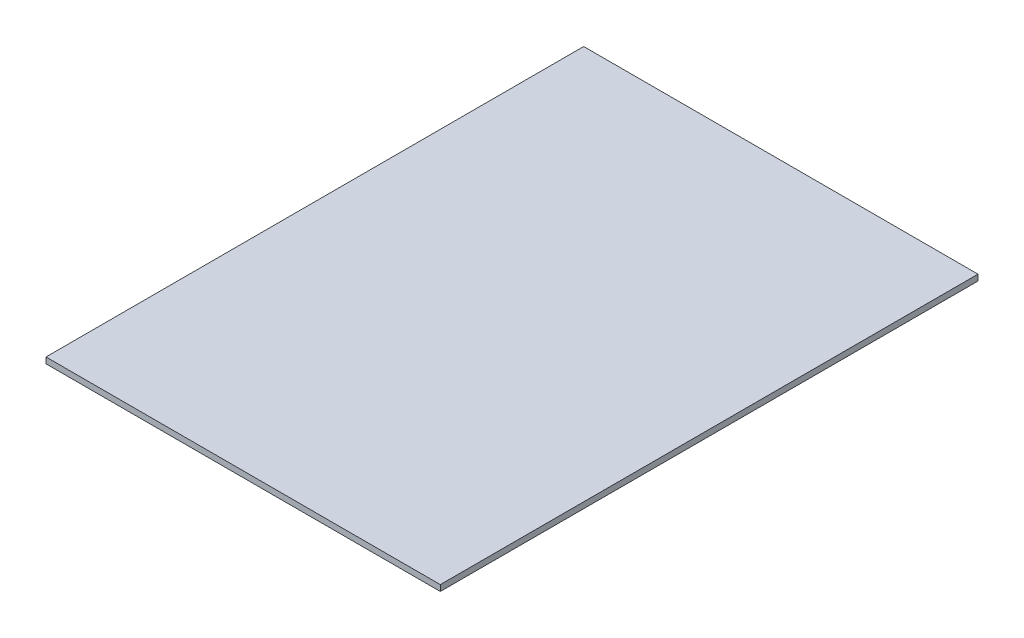
ISO-10303-21;
HEADER;
FILE_DESCRIPTION(('STEP AP214'),'2;1');
FILE_NAME('part.step','',(''),(''),'','','');
FILE_SCHEMA(('AUTOMOTIVE_DESIGN { 1 0 10303 214 1 1 1 1 }'));
ENDSEC;
DATA;
#1=APPLICATION_CONTEXT('core data for automotive mechanical design processes');
#2=APPLICATION_PROTOCOL_DEFINITION('international standard','automotive_design',2000,#1);
#3=PRODUCT_CONTEXT('',#1,'mechanical');
#4=PRODUCT('Part','Part','',(#3));
#5=PRODUCT_RELATED_PRODUCT_CATEGORY('part','',(#4));
#6=PRODUCT_DEFINITION_FORMATION('','',#4);
#7=PRODUCT_DEFINITION_CONTEXT('part definition',#1,'design');
#8=PRODUCT_DEFINITION('design','',#6,#7);
#9=PRODUCT_DEFINITION_SHAPE('','',#8);
#10=(LENGTH_UNIT() NAMED_UNIT(*) SI_UNIT(.MILLI.,.METRE.));
#11=(NAMED_UNIT(*) PLANE_ANGLE_UNIT() SI_UNIT($,.RADIAN.));
#12=(NAMED_UNIT(*) SI_UNIT($,.STERADIAN.) SOLID_ANGLE_UNIT());
#13=UNCERTAINTY_MEASURE_WITH_UNIT(LENGTH_MEASURE(1.E-05),#10,'distance_accuracy_value','');
#14=(GEOMETRIC_REPRESENTATION_CONTEXT(3) GLOBAL_UNCERTAINTY_ASSIGNED_CONTEXT((#13)) GLOBAL_UNIT_ASSIGNED_CONTEXT((#10,
#11,#12)) REPRESENTATION_CONTEXT('',''));
#15=CARTESIAN_POINT('',(0.,0.,0.));
#16=DIRECTION('',(0.,0.,1.));
#17=DIRECTION('',(1.,0.,0.));
#18=AXIS2_PLACEMENT_3D('',#15,#16,#17);
#19=CARTESIAN_POINT('',(0.,25.4,0.));
#20=DIRECTION('',(1.,0.,0.));
#21=DIRECTION('',(0.,0.,-1.));
#22=AXIS2_PLACEMENT_3D('',#19,#20,#21);
#23=PLANE('',#22);
#24=DIRECTION('',(0.,0.,1.));
#25=VECTOR('',#24,1.);
#26=CARTESIAN_POINT('',(0.,0.,0.));
#27=LINE('',#26,#25);
#28=CARTESIAN_POINT('',(0.,0.,0.));
#29=VERTEX_POINT('',#28);
#30=CARTESIAN_POINT('',(2.79954258285085E-13,0.,2286.));
#31=VERTEX_POINT('',#30);
#32=EDGE_CURVE('E96',#29,#31,#27,.T.);
#33=ORIENTED_EDGE('',*,*,#32,.T.);
#34=DIRECTION('',(0.,-1.,0.));
#35=VECTOR('',#34,1.);
#36=CARTESIAN_POINT('',(2.79954258285085E-13,25.4,2286.));
#37=LINE('',#36,#35);
#38=CARTESIAN_POINT('',(2.79954258285085E-13,25.4,2286.));
#39=VERTEX_POINT('',#38);
#40=EDGE_CURVE('E11',#39,#31,#37,.T.);
#41=ORIENTED_EDGE('',*,*,#40,.F.);
#42=DIRECTION('',(0.,0.,1.));
#43=VECTOR('',#42,1.);
#44=CARTESIAN_POINT('',(0.,25.4,0.));
#45=LINE('',#44,#43);
#46=CARTESIAN_POINT('',(0.,25.4,0.));
#47=VERTEX_POINT('',#46);
#48=EDGE_CURVE('E84',#47,#39,#45,.T.);
#49=ORIENTED_EDGE('',*,*,#48,.F.);
#50=DIRECTION('',(0.,-1.,0.));
#51=VECTOR('',#50,1.);
#52=CARTESIAN_POINT('',(0.,25.4,0.));
#53=LINE('',#52,#51);
#54=EDGE_CURVE('E92',#47,#29,#53,.T.);
#55=ORIENTED_EDGE('',*,*,#54,.T.);
#56=EDGE_LOOP('',(#33,#41,#49,#55));
#57=FACE_BOUND('',#56,.T.);
#58=ADVANCED_FACE('F33',(#57),#23,.F.);
#59=CARTESIAN_POINT('',(2.79954258285085E-13,25.4,2286.));
#60=DIRECTION('',(0.,0.,-1.));
#61=DIRECTION('',(-1.,0.,0.));
#62=AXIS2_PLACEMENT_3D('',#59,#60,#61);
#63=PLANE('',#62);
#64=DIRECTION('',(1.,0.,0.));
#65=VECTOR('',#64,1.);
#66=CARTESIAN_POINT('',(2.79954258285085E-13,0.,2286.));
#67=LINE('',#66,#65);
#68=CARTESIAN_POINT('',(1676.4,0.,2286.));
#69=VERTEX_POINT('',#68);
#70=EDGE_CURVE('E88',#31,#69,#67,.T.);
#71=ORIENTED_EDGE('',*,*,#70,.T.);
#72=DIRECTION('',(0.,-1.,0.));
#73=VECTOR('',#72,1.);
#74=CARTESIAN_POINT('',(1676.4,25.4,2286.));
#75=LINE('',#74,#73);
#76=CARTESIAN_POINT('',(1676.4,25.4,2286.));
#77=VERTEX_POINT('',#76);
#78=EDGE_CURVE('E41',#77,#69,#75,.T.);
#79=ORIENTED_EDGE('',*,*,#78,.F.);
#80=DIRECTION('',(1.,0.,0.));
#81=VECTOR('',#80,1.);
#82=CARTESIAN_POINT('',(2.79954258285085E-13,25.4,2286.));
#83=LINE('',#82,#81);
#84=EDGE_CURVE('E79',#39,#77,#83,.T.);
#85=ORIENTED_EDGE('',*,*,#84,.F.);
#86=ORIENTED_EDGE('',*,*,#40,.T.);
#87=EDGE_LOOP('',(#71,#79,#85,#86));
#88=FACE_BOUND('',#87,.T.);
#89=ADVANCED_FACE('F87',(#88),#63,.F.);
#90=CARTESIAN_POINT('',(1676.4,25.4,0.));
#91=DIRECTION('',(-1.,0.,0.));
#92=DIRECTION('',(0.,0.,1.));
#93=AXIS2_PLACEMENT_3D('',#90,#91,#92);
#94=PLANE('',#93);
#95=DIRECTION('',(0.,0.,-1.));
#96=VECTOR('',#95,1.);
#97=CARTESIAN_POINT('',(1676.4,0.,0.));
#98=LINE('',#97,#96);
#99=CARTESIAN_POINT('',(1676.4,0.,0.));
#100=VERTEX_POINT('',#99);
#101=EDGE_CURVE('E66',#69,#100,#98,.T.);
#102=ORIENTED_EDGE('',*,*,#101,.T.);
#103=DIRECTION('',(0.,-1.,0.));
#104=VECTOR('',#103,1.);
#105=CARTESIAN_POINT('',(1676.4,25.4,0.));
#106=LINE('',#105,#104);
#107=CARTESIAN_POINT('',(1676.4,25.4,0.));
#108=VERTEX_POINT('',#107);
#109=EDGE_CURVE('E89',#108,#100,#106,.T.);
#110=ORIENTED_EDGE('',*,*,#109,.F.);
#111=DIRECTION('',(0.,0.,-1.));
#112=VECTOR('',#111,1.);
#113=CARTESIAN_POINT('',(1676.4,25.4,0.));
#114=LINE('',#113,#112);
#115=EDGE_CURVE('E82',#77,#108,#114,.T.);
#116=ORIENTED_EDGE('',*,*,#115,.F.);
#117=ORIENTED_EDGE('',*,*,#78,.T.);
#118=EDGE_LOOP('',(#102,#110,#116,#117));
#119=FACE_BOUND('',#118,.T.);
#120=ADVANCED_FACE('F90',(#119),#94,.F.);
#121=CARTESIAN_POINT('',(0.,25.4,0.));
#122=DIRECTION('',(0.,0.,1.));
#123=DIRECTION('',(1.,0.,0.));
#124=AXIS2_PLACEMENT_3D('',#121,#122,#123);
#125=PLANE('',#124);
#126=DIRECTION('',(-1.,0.,0.));
#127=VECTOR('',#126,1.);
#128=CARTESIAN_POINT('',(0.,0.,0.));
#129=LINE('',#128,#127);
#130=EDGE_CURVE('E72',#100,#29,#129,.T.);
#131=ORIENTED_EDGE('',*,*,#130,.T.);
#132=ORIENTED_EDGE('',*,*,#54,.F.);
#133=DIRECTION('',(-1.,0.,0.));
#134=VECTOR('',#133,1.);
#135=CARTESIAN_POINT('',(0.,25.4,0.));
#136=LINE('',#135,#134);
#137=EDGE_CURVE('E49',#108,#47,#136,.T.);
#138=ORIENTED_EDGE('',*,*,#137,.F.);
#139=ORIENTED_EDGE('',*,*,#109,.T.);
#140=EDGE_LOOP('',(#131,#132,#138,#139));
#141=FACE_BOUND('',#140,.T.);
#142=ADVANCED_FACE('F103',(#141),#125,.F.);
#143=CARTESIAN_POINT('',(0.,25.4,0.));
#144=DIRECTION('',(0.,1.,0.));
#145=DIRECTION('',(0.,0.,1.));
#146=AXIS2_PLACEMENT_3D('',#143,#144,#145);
#147=PLANE('',#146);
#148=ORIENTED_EDGE('',*,*,#48,.T.);
#149=ORIENTED_EDGE('',*,*,#84,.T.);
#150=ORIENTED_EDGE('',*,*,#115,.T.);
#151=ORIENTED_EDGE('',*,*,#137,.T.);
#152=EDGE_LOOP('',(#148,#149,#150,#151));
#153=FACE_BOUND('',#152,.T.);
#154=ADVANCED_FACE('F80',(#153),#147,.T.);
#155=CARTESIAN_POINT('',(0.,0.,0.));
#156=DIRECTION('',(0.,1.,0.));
#157=DIRECTION('',(0.,0.,1.));
#158=AXIS2_PLACEMENT_3D('',#155,#156,#157);
#159=PLANE('',#158);
#160=ORIENTED_EDGE('',*,*,#32,.F.);
#161=ORIENTED_EDGE('',*,*,#130,.F.);
#162=ORIENTED_EDGE('',*,*,#101,.F.);
#163=ORIENTED_EDGE('',*,*,#70,.F.);
#164=EDGE_LOOP('',(#160,#161,#162,#163));
#165=FACE_BOUND('',#164,.T.);
#166=ADVANCED_FACE('F106',(#165),#159,.F.);
#167=CLOSED_SHELL('',(#58,#89,#120,#142,#154,#166));
#168=MANIFOLD_SOLID_BREP('B2',#167);
#169=ADVANCED_BREP_SHAPE_REPRESENTATION('',(#18,#168),#14);
#170=SHAPE_DEFINITION_REPRESENTATION(#9,#169);
ENDSEC;
END-ISO-10303-21;
